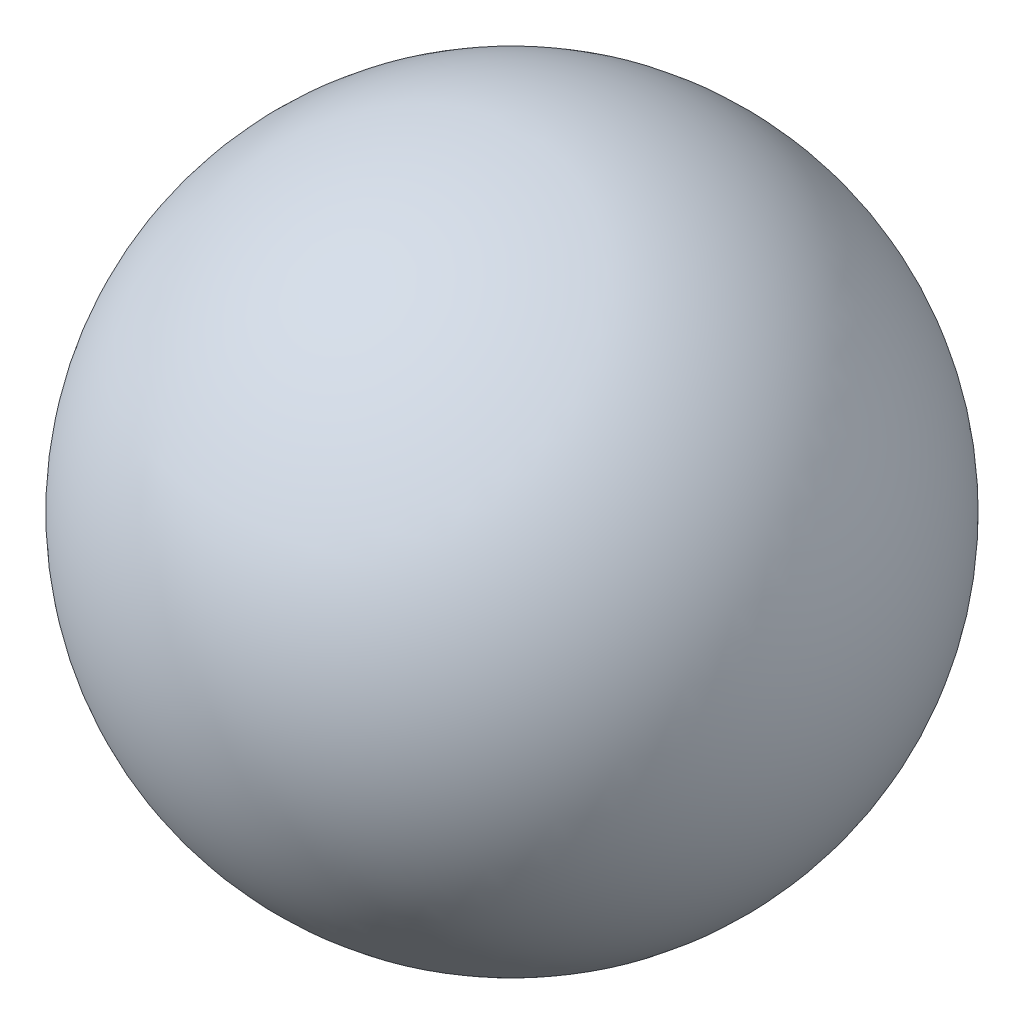
ISO-10303-21;
HEADER;
FILE_DESCRIPTION(('STEP AP214'),'2;1');
FILE_NAME('part.step','',(''),(''),'','','');
FILE_SCHEMA(('AUTOMOTIVE_DESIGN { 1 0 10303 214 1 1 1 1 }'));
ENDSEC;
DATA;
#1=APPLICATION_CONTEXT('core data for automotive mechanical design processes');
#2=APPLICATION_PROTOCOL_DEFINITION('international standard','automotive_design',2000,#1);
#3=PRODUCT_CONTEXT('',#1,'mechanical');
#4=PRODUCT('Part','Part','',(#3));
#5=PRODUCT_RELATED_PRODUCT_CATEGORY('part','',(#4));
#6=PRODUCT_DEFINITION_FORMATION('','',#4);
#7=PRODUCT_DEFINITION_CONTEXT('part definition',#1,'design');
#8=PRODUCT_DEFINITION('design','',#6,#7);
#9=PRODUCT_DEFINITION_SHAPE('','',#8);
#10=(LENGTH_UNIT() NAMED_UNIT(*) SI_UNIT(.MILLI.,.METRE.));
#11=(NAMED_UNIT(*) PLANE_ANGLE_UNIT() SI_UNIT($,.RADIAN.));
#12=(NAMED_UNIT(*) SI_UNIT($,.STERADIAN.) SOLID_ANGLE_UNIT());
#13=UNCERTAINTY_MEASURE_WITH_UNIT(LENGTH_MEASURE(1.E-05),#10,'distance_accuracy_value','');
#14=(GEOMETRIC_REPRESENTATION_CONTEXT(3) GLOBAL_UNCERTAINTY_ASSIGNED_CONTEXT((#13)) GLOBAL_UNIT_ASSIGNED_CONTEXT((#10,
#11,#12)) REPRESENTATION_CONTEXT('',''));
#15=CARTESIAN_POINT('',(0.,0.,0.));
#16=DIRECTION('',(0.,0.,1.));
#17=DIRECTION('',(1.,0.,0.));
#18=AXIS2_PLACEMENT_3D('',#15,#16,#17);
#19=CARTESIAN_POINT('',(0.,0.,0.));
#20=DIRECTION('',(0.,-1.,0.));
#21=DIRECTION('',(-1.,0.,0.));
#22=AXIS2_PLACEMENT_3D('',#19,#20,#21);
#23=SPHERICAL_SURFACE('',#22,21.5000000000001);
#24=CARTESIAN_POINT('',(0.,-21.5000000000001,0.));
#25=VERTEX_POINT('',#24);
#26=VERTEX_LOOP('',#25);
#27=FACE_BOUND('',#26,.T.);
#28=ADVANCED_FACE('F32',(#27),#23,.T.);
#29=CLOSED_SHELL('',(#28));
#30=MANIFOLD_SOLID_BREP('B2',#29);
#31=ADVANCED_BREP_SHAPE_REPRESENTATION('',(#18,#30),#14);
#32=SHAPE_DEFINITION_REPRESENTATION(#9,#31);
ENDSEC;
END-ISO-10303-21;
